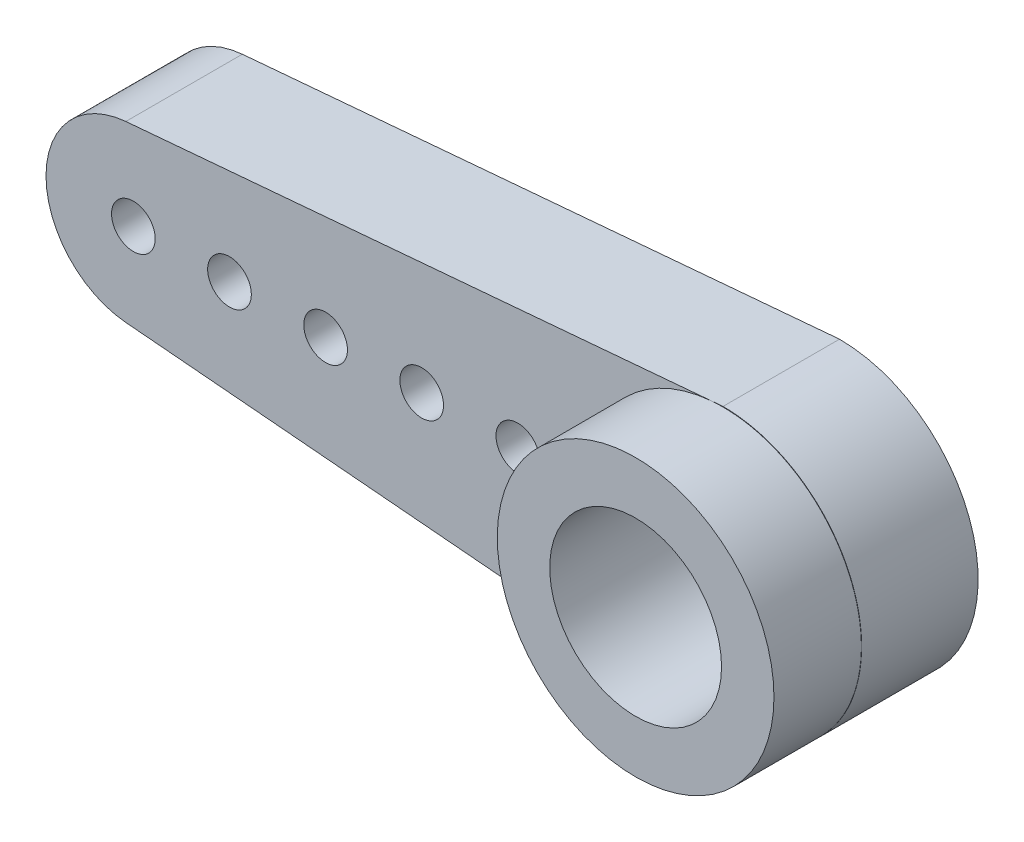
ISO-10303-21;
HEADER;
FILE_DESCRIPTION(('STEP AP214'),'2;1');
FILE_NAME('part.step','',(''),(''),'','','');
FILE_SCHEMA(('AUTOMOTIVE_DESIGN { 1 0 10303 214 1 1 1 1 }'));
ENDSEC;
DATA;
#1=APPLICATION_CONTEXT('core data for automotive mechanical design processes');
#2=APPLICATION_PROTOCOL_DEFINITION('international standard','automotive_design',2000,#1);
#3=PRODUCT_CONTEXT('',#1,'mechanical');
#4=PRODUCT('Part','Part','',(#3));
#5=PRODUCT_RELATED_PRODUCT_CATEGORY('part','',(#4));
#6=PRODUCT_DEFINITION_FORMATION('','',#4);
#7=PRODUCT_DEFINITION_CONTEXT('part definition',#1,'design');
#8=PRODUCT_DEFINITION('design','',#6,#7);
#9=PRODUCT_DEFINITION_SHAPE('','',#8);
#10=(LENGTH_UNIT() NAMED_UNIT(*) SI_UNIT(.MILLI.,.METRE.));
#11=(NAMED_UNIT(*) PLANE_ANGLE_UNIT() SI_UNIT($,.RADIAN.));
#12=(NAMED_UNIT(*) SI_UNIT($,.STERADIAN.) SOLID_ANGLE_UNIT());
#13=UNCERTAINTY_MEASURE_WITH_UNIT(LENGTH_MEASURE(1.E-05),#10,'distance_accuracy_value','');
#14=(GEOMETRIC_REPRESENTATION_CONTEXT(3) GLOBAL_UNCERTAINTY_ASSIGNED_CONTEXT((#13)) GLOBAL_UNIT_ASSIGNED_CONTEXT((#10,
#11,#12)) REPRESENTATION_CONTEXT('',''));
#15=CARTESIAN_POINT('',(0.,0.,0.));
#16=DIRECTION('',(0.,0.,1.));
#17=DIRECTION('',(1.,0.,0.));
#18=AXIS2_PLACEMENT_3D('',#15,#16,#17);
#19=CARTESIAN_POINT('',(0.000772804097320617,0.0089066542155656,4.));
#20=DIRECTION('',(0.,0.,-1.));
#21=DIRECTION('',(-1.,0.,0.));
#22=AXIS2_PLACEMENT_3D('',#19,#20,#21);
#23=PLANE('',#22);
#24=CARTESIAN_POINT('',(0.,0.,4.));
#25=DIRECTION('',(0.,0.,1.));
#26=DIRECTION('',(1.,0.,0.));
#27=AXIS2_PLACEMENT_3D('',#24,#25,#26);
#28=CIRCLE('',#27,4.75);
#29=CARTESIAN_POINT('',(-0.41060076979759,4.73222009292062,4.));
#30=VERTEX_POINT('',#29);
#31=CARTESIAN_POINT('',(-0.410600769797589,-4.73222009292062,4.));
#32=VERTEX_POINT('',#31);
#33=EDGE_CURVE('E48',#30,#32,#28,.T.);
#34=ORIENTED_EDGE('',*,*,#33,.F.);
#35=DIRECTION('',(-0.996256861667499,-0.0864422673258083,0.));
#36=VECTOR('',#35,1.);
#37=CARTESIAN_POINT('',(0.,4.76784670978288,4.));
#38=LINE('',#37,#36);
#39=CARTESIAN_POINT('',(-20.504052607284,2.9887705850025,4.));
#40=VERTEX_POINT('',#39);
#41=EDGE_CURVE('E95',#30,#40,#38,.T.);
#42=ORIENTED_EDGE('',*,*,#41,.T.);
#43=CARTESIAN_POINT('',(-20.2447258053066,0.,4.));
#44=DIRECTION('',(0.,0.,1.));
#45=DIRECTION('',(1.,0.,0.));
#46=AXIS2_PLACEMENT_3D('',#43,#44,#45);
#47=CIRCLE('',#46,3.);
#48=CARTESIAN_POINT('',(-20.504052607284,-2.9887705850025,4.));
#49=VERTEX_POINT('',#48);
#50=EDGE_CURVE('E94',#40,#49,#47,.T.);
#51=ORIENTED_EDGE('',*,*,#50,.T.);
#52=DIRECTION('',(0.996256861667498,-0.0864422673258083,0.));
#53=VECTOR('',#52,1.);
#54=CARTESIAN_POINT('',(-20.504052607284,-2.9887705850025,4.));
#55=LINE('',#54,#53);
#56=EDGE_CURVE('E106',#49,#32,#55,.T.);
#57=ORIENTED_EDGE('',*,*,#56,.T.);
#58=EDGE_LOOP('',(#34,#42,#51,#57));
#59=FACE_BOUND('',#58,.T.);
#60=CARTESIAN_POINT('',(-16.9447258053066,0.,4.));
#61=DIRECTION('',(0.,0.,1.));
#62=DIRECTION('',(1.,0.,0.));
#63=AXIS2_PLACEMENT_3D('',#60,#61,#62);
#64=CIRCLE('',#63,0.750000000000002);
#65=CARTESIAN_POINT('',(-16.1947258053066,0.,4.));
#66=VERTEX_POINT('',#65);
#67=EDGE_CURVE('E159',#66,#66,#64,.T.);
#68=ORIENTED_EDGE('',*,*,#67,.F.);
#69=EDGE_LOOP('',(#68));
#70=FACE_BOUND('',#69,.T.);
#71=CARTESIAN_POINT('',(-13.6447258053066,0.,4.));
#72=DIRECTION('',(0.,0.,1.));
#73=DIRECTION('',(1.,0.,0.));
#74=AXIS2_PLACEMENT_3D('',#71,#72,#73);
#75=CIRCLE('',#74,0.750000000000002);
#76=CARTESIAN_POINT('',(-12.8947258053066,0.,4.));
#77=VERTEX_POINT('',#76);
#78=EDGE_CURVE('E199',#77,#77,#75,.T.);
#79=ORIENTED_EDGE('',*,*,#78,.F.);
#80=EDGE_LOOP('',(#79));
#81=FACE_BOUND('',#80,.T.);
#82=CARTESIAN_POINT('',(-20.2447258053066,0.,4.));
#83=DIRECTION('',(0.,0.,1.));
#84=DIRECTION('',(1.,0.,0.));
#85=AXIS2_PLACEMENT_3D('',#82,#83,#84);
#86=CIRCLE('',#85,0.750000000000002);
#87=CARTESIAN_POINT('',(-19.4947258053066,0.,4.));
#88=VERTEX_POINT('',#87);
#89=EDGE_CURVE('E194',#88,#88,#86,.T.);
#90=ORIENTED_EDGE('',*,*,#89,.F.);
#91=EDGE_LOOP('',(#90));
#92=FACE_BOUND('',#91,.T.);
#93=CARTESIAN_POINT('',(-10.3447258053066,0.,4.));
#94=DIRECTION('',(0.,0.,1.));
#95=DIRECTION('',(1.,0.,0.));
#96=AXIS2_PLACEMENT_3D('',#93,#94,#95);
#97=CIRCLE('',#96,0.750000000000002);
#98=CARTESIAN_POINT('',(-9.59472580530658,0.,4.));
#99=VERTEX_POINT('',#98);
#100=EDGE_CURVE('E189',#99,#99,#97,.T.);
#101=ORIENTED_EDGE('',*,*,#100,.F.);
#102=EDGE_LOOP('',(#101));
#103=FACE_BOUND('',#102,.T.);
#104=CARTESIAN_POINT('',(-7.04472580530658,0.,4.));
#105=DIRECTION('',(0.,0.,1.));
#106=DIRECTION('',(1.,0.,0.));
#107=AXIS2_PLACEMENT_3D('',#104,#105,#106);
#108=CIRCLE('',#107,0.750000000000002);
#109=CARTESIAN_POINT('',(-6.29472580530657,0.,4.));
#110=VERTEX_POINT('',#109);
#111=EDGE_CURVE('E181',#110,#110,#108,.T.);
#112=ORIENTED_EDGE('',*,*,#111,.F.);
#113=EDGE_LOOP('',(#112));
#114=FACE_BOUND('',#113,.T.);
#115=ADVANCED_FACE('F37',(#59,#70,#81,#92,#103,#114),#23,.F.);
#116=EDGE_CURVE('E11',#32,#30,#28,.T.);
#117=ORIENTED_EDGE('',*,*,#116,.F.);
#118=CARTESIAN_POINT('',(0.000772804097320617,0.0089066542155656,4.));
#119=DIRECTION('',(0.,0.,1.));
#120=DIRECTION('',(-1.,0.,0.));
#121=AXIS2_PLACEMENT_3D('',#118,#119,#120);
#122=CIRCLE('',#121,4.75894011831513);
#123=CARTESIAN_POINT('',(0.,4.76784670978288,4.));
#124=VERTEX_POINT('',#123);
#125=EDGE_CURVE('E92',#32,#124,#122,.T.);
#126=ORIENTED_EDGE('',*,*,#125,.T.);
#127=EDGE_CURVE('E87',#124,#30,#38,.T.);
#128=ORIENTED_EDGE('',*,*,#127,.T.);
#129=EDGE_LOOP('',(#117,#126,#128));
#130=FACE_BOUND('',#129,.T.);
#131=ADVANCED_FACE('F90',(#130),#23,.F.);
#132=CARTESIAN_POINT('',(0.000772804097320617,0.0089066542155656,0.));
#133=DIRECTION('',(0.,0.,-1.));
#134=DIRECTION('',(-1.,0.,0.));
#135=AXIS2_PLACEMENT_3D('',#132,#133,#134);
#136=PLANE('',#135);
#137=CARTESIAN_POINT('',(-10.3447258053066,0.,0.));
#138=DIRECTION('',(0.,0.,1.));
#139=DIRECTION('',(1.,0.,0.));
#140=AXIS2_PLACEMENT_3D('',#137,#138,#139);
#141=CIRCLE('',#140,0.750000000000002);
#142=CARTESIAN_POINT('',(-9.59472580530658,0.,0.));
#143=VERTEX_POINT('',#142);
#144=EDGE_CURVE('E184',#143,#143,#141,.T.);
#145=ORIENTED_EDGE('',*,*,#144,.T.);
#146=EDGE_LOOP('',(#145));
#147=FACE_BOUND('',#146,.T.);
#148=CARTESIAN_POINT('',(-13.6447258053066,0.,0.));
#149=DIRECTION('',(0.,0.,1.));
#150=DIRECTION('',(1.,0.,0.));
#151=AXIS2_PLACEMENT_3D('',#148,#149,#150);
#152=CIRCLE('',#151,0.750000000000002);
#153=CARTESIAN_POINT('',(-12.8947258053066,0.,0.));
#154=VERTEX_POINT('',#153);
#155=EDGE_CURVE('E197',#154,#154,#152,.T.);
#156=ORIENTED_EDGE('',*,*,#155,.T.);
#157=EDGE_LOOP('',(#156));
#158=FACE_BOUND('',#157,.T.);
#159=CARTESIAN_POINT('',(0.,0.,0.));
#160=DIRECTION('',(0.,0.,1.));
#161=DIRECTION('',(1.,0.,0.));
#162=AXIS2_PLACEMENT_3D('',#159,#160,#161);
#163=CIRCLE('',#162,2.95);
#164=CARTESIAN_POINT('',(2.95,0.,0.));
#165=VERTEX_POINT('',#164);
#166=EDGE_CURVE('E155',#165,#165,#163,.T.);
#167=ORIENTED_EDGE('',*,*,#166,.T.);
#168=EDGE_LOOP('',(#167));
#169=FACE_BOUND('',#168,.T.);
#170=CARTESIAN_POINT('',(0.000772804097320617,0.0089066542155656,0.));
#171=DIRECTION('',(0.,0.,1.));
#172=DIRECTION('',(-1.,0.,0.));
#173=AXIS2_PLACEMENT_3D('',#170,#171,#172);
#174=CIRCLE('',#173,4.75894011831513);
#175=CARTESIAN_POINT('',(-0.410600769797589,-4.73222009292062,0.));
#176=VERTEX_POINT('',#175);
#177=CARTESIAN_POINT('',(0.,4.76784670978288,0.));
#178=VERTEX_POINT('',#177);
#179=EDGE_CURVE('E151',#176,#178,#174,.T.);
#180=ORIENTED_EDGE('',*,*,#179,.F.);
#181=DIRECTION('',(0.996256861667498,-0.0864422673258083,0.));
#182=VECTOR('',#181,1.);
#183=CARTESIAN_POINT('',(-20.504052607284,-2.9887705850025,0.));
#184=LINE('',#183,#182);
#185=CARTESIAN_POINT('',(-20.504052607284,-2.9887705850025,0.));
#186=VERTEX_POINT('',#185);
#187=EDGE_CURVE('E80',#186,#176,#184,.T.);
#188=ORIENTED_EDGE('',*,*,#187,.F.);
#189=CARTESIAN_POINT('',(-20.2447258053066,0.,0.));
#190=DIRECTION('',(0.,0.,1.));
#191=DIRECTION('',(1.,0.,0.));
#192=AXIS2_PLACEMENT_3D('',#189,#190,#191);
#193=CIRCLE('',#192,3.);
#194=CARTESIAN_POINT('',(-20.504052607284,2.9887705850025,0.));
#195=VERTEX_POINT('',#194);
#196=EDGE_CURVE('E73',#195,#186,#193,.T.);
#197=ORIENTED_EDGE('',*,*,#196,.F.);
#198=DIRECTION('',(-0.996256861667499,-0.0864422673258083,0.));
#199=VECTOR('',#198,1.);
#200=CARTESIAN_POINT('',(0.,4.76784670978288,0.));
#201=LINE('',#200,#199);
#202=EDGE_CURVE('E154',#178,#195,#201,.T.);
#203=ORIENTED_EDGE('',*,*,#202,.F.);
#204=EDGE_LOOP('',(#180,#188,#197,#203));
#205=FACE_BOUND('',#204,.T.);
#206=CARTESIAN_POINT('',(-16.9447258053066,0.,0.));
#207=DIRECTION('',(0.,0.,1.));
#208=DIRECTION('',(1.,0.,0.));
#209=AXIS2_PLACEMENT_3D('',#206,#207,#208);
#210=CIRCLE('',#209,0.750000000000002);
#211=CARTESIAN_POINT('',(-16.1947258053066,0.,0.));
#212=VERTEX_POINT('',#211);
#213=EDGE_CURVE('E172',#212,#212,#210,.T.);
#214=ORIENTED_EDGE('',*,*,#213,.T.);
#215=EDGE_LOOP('',(#214));
#216=FACE_BOUND('',#215,.T.);
#217=CARTESIAN_POINT('',(-20.2447258053066,0.,0.));
#218=DIRECTION('',(0.,0.,1.));
#219=DIRECTION('',(1.,0.,0.));
#220=AXIS2_PLACEMENT_3D('',#217,#218,#219);
#221=CIRCLE('',#220,0.750000000000002);
#222=CARTESIAN_POINT('',(-19.4947258053066,0.,0.));
#223=VERTEX_POINT('',#222);
#224=EDGE_CURVE('E176',#223,#223,#221,.T.);
#225=ORIENTED_EDGE('',*,*,#224,.T.);
#226=EDGE_LOOP('',(#225));
#227=FACE_BOUND('',#226,.T.);
#228=CARTESIAN_POINT('',(-7.04472580530658,0.,0.));
#229=DIRECTION('',(0.,0.,1.));
#230=DIRECTION('',(1.,0.,0.));
#231=AXIS2_PLACEMENT_3D('',#228,#229,#230);
#232=CIRCLE('',#231,0.750000000000002);
#233=CARTESIAN_POINT('',(-6.29472580530657,0.,0.));
#234=VERTEX_POINT('',#233);
#235=EDGE_CURVE('E179',#234,#234,#232,.T.);
#236=ORIENTED_EDGE('',*,*,#235,.T.);
#237=EDGE_LOOP('',(#236));
#238=FACE_BOUND('',#237,.T.);
#239=ADVANCED_FACE('F129',(#147,#158,#169,#205,#216,#227,#238),#136,.T.);
#240=CARTESIAN_POINT('',(0.000772804097320617,0.0089066542155656,4.));
#241=DIRECTION('',(0.,0.,-1.));
#242=DIRECTION('',(-1.,0.,0.));
#243=AXIS2_PLACEMENT_3D('',#240,#241,#242);
#244=CYLINDRICAL_SURFACE('',#243,4.75894011831513);
#245=ORIENTED_EDGE('',*,*,#179,.T.);
#246=DIRECTION('',(0.,0.,-1.));
#247=VECTOR('',#246,1.);
#248=CARTESIAN_POINT('',(0.,4.76784670978288,4.));
#249=LINE('',#248,#247);
#250=EDGE_CURVE('E41',#124,#178,#249,.T.);
#251=ORIENTED_EDGE('',*,*,#250,.F.);
#252=ORIENTED_EDGE('',*,*,#125,.F.);
#253=DIRECTION('',(0.,0.,-1.));
#254=VECTOR('',#253,1.);
#255=CARTESIAN_POINT('',(-0.410600769797589,-4.73222009292062,4.));
#256=LINE('',#255,#254);
#257=EDGE_CURVE('E152',#32,#176,#256,.T.);
#258=ORIENTED_EDGE('',*,*,#257,.T.);
#259=EDGE_LOOP('',(#245,#251,#252,#258));
#260=FACE_BOUND('',#259,.T.);
#261=ADVANCED_FACE('F39',(#260),#244,.T.);
#262=CARTESIAN_POINT('',(0.,4.76784670978288,4.));
#263=DIRECTION('',(0.0864422673258083,-0.996256861667499,0.));
#264=DIRECTION('',(0.996256861667499,0.0864422673258083,0.));
#265=AXIS2_PLACEMENT_3D('',#262,#263,#264);
#266=PLANE('',#265);
#267=ORIENTED_EDGE('',*,*,#202,.T.);
#268=DIRECTION('',(0.,0.,-1.));
#269=VECTOR('',#268,1.);
#270=CARTESIAN_POINT('',(-20.504052607284,2.9887705850025,4.));
#271=LINE('',#270,#269);
#272=EDGE_CURVE('E100',#40,#195,#271,.T.);
#273=ORIENTED_EDGE('',*,*,#272,.F.);
#274=ORIENTED_EDGE('',*,*,#41,.F.);
#275=ORIENTED_EDGE('',*,*,#127,.F.);
#276=ORIENTED_EDGE('',*,*,#250,.T.);
#277=EDGE_LOOP('',(#267,#273,#274,#275,#276));
#278=FACE_BOUND('',#277,.T.);
#279=ADVANCED_FACE('F99',(#278),#266,.F.);
#280=CARTESIAN_POINT('',(-20.2447258053066,0.,4.));
#281=DIRECTION('',(0.,0.,-1.));
#282=DIRECTION('',(-1.,0.,0.));
#283=AXIS2_PLACEMENT_3D('',#280,#281,#282);
#284=CYLINDRICAL_SURFACE('',#283,3.);
#285=ORIENTED_EDGE('',*,*,#196,.T.);
#286=DIRECTION('',(0.,0.,-1.));
#287=VECTOR('',#286,1.);
#288=CARTESIAN_POINT('',(-20.504052607284,-2.9887705850025,4.));
#289=LINE('',#288,#287);
#290=EDGE_CURVE('E167',#49,#186,#289,.T.);
#291=ORIENTED_EDGE('',*,*,#290,.F.);
#292=ORIENTED_EDGE('',*,*,#50,.F.);
#293=ORIENTED_EDGE('',*,*,#272,.T.);
#294=EDGE_LOOP('',(#285,#291,#292,#293));
#295=FACE_BOUND('',#294,.T.);
#296=ADVANCED_FACE('F140',(#295),#284,.T.);
#297=CARTESIAN_POINT('',(-20.504052607284,-2.9887705850025,4.));
#298=DIRECTION('',(0.0864422673258083,0.996256861667499,0.));
#299=DIRECTION('',(-0.996256861667499,0.0864422673258083,0.));
#300=AXIS2_PLACEMENT_3D('',#297,#298,#299);
#301=PLANE('',#300);
#302=ORIENTED_EDGE('',*,*,#187,.T.);
#303=ORIENTED_EDGE('',*,*,#257,.F.);
#304=ORIENTED_EDGE('',*,*,#56,.F.);
#305=ORIENTED_EDGE('',*,*,#290,.T.);
#306=EDGE_LOOP('',(#302,#303,#304,#305));
#307=FACE_BOUND('',#306,.T.);
#308=ADVANCED_FACE('F137',(#307),#301,.F.);
#309=CARTESIAN_POINT('',(0.,0.,4.));
#310=DIRECTION('',(0.,0.,-1.));
#311=DIRECTION('',(-1.,0.,0.));
#312=AXIS2_PLACEMENT_3D('',#309,#310,#311);
#313=CYLINDRICAL_SURFACE('',#312,2.95);
#314=ORIENTED_EDGE('',*,*,#166,.F.);
#315=EDGE_LOOP('',(#314));
#316=FACE_BOUND('',#315,.T.);
#317=CARTESIAN_POINT('',(0.,0.,7.));
#318=DIRECTION('',(0.,0.,1.));
#319=DIRECTION('',(1.,0.,0.));
#320=AXIS2_PLACEMENT_3D('',#317,#318,#319);
#321=CIRCLE('',#320,2.95);
#322=CARTESIAN_POINT('',(2.95,0.,7.));
#323=VERTEX_POINT('',#322);
#324=EDGE_CURVE('E109',#323,#323,#321,.T.);
#325=ORIENTED_EDGE('',*,*,#324,.T.);
#326=EDGE_LOOP('',(#325));
#327=FACE_BOUND('',#326,.T.);
#328=ADVANCED_FACE('F132',(#316,#327),#313,.F.);
#329=CARTESIAN_POINT('',(-16.9447258053066,0.,4.));
#330=DIRECTION('',(0.,0.,-1.));
#331=DIRECTION('',(-1.,0.,0.));
#332=AXIS2_PLACEMENT_3D('',#329,#330,#331);
#333=CYLINDRICAL_SURFACE('',#332,0.750000000000002);
#334=ORIENTED_EDGE('',*,*,#67,.T.);
#335=EDGE_LOOP('',(#334));
#336=FACE_BOUND('',#335,.T.);
#337=ORIENTED_EDGE('',*,*,#213,.F.);
#338=EDGE_LOOP('',(#337));
#339=FACE_BOUND('',#338,.T.);
#340=ADVANCED_FACE('F209',(#336,#339),#333,.F.);
#341=CARTESIAN_POINT('',(-13.6447258053066,0.,4.));
#342=DIRECTION('',(0.,0.,-1.));
#343=DIRECTION('',(-1.,0.,0.));
#344=AXIS2_PLACEMENT_3D('',#341,#342,#343);
#345=CYLINDRICAL_SURFACE('',#344,0.750000000000002);
#346=ORIENTED_EDGE('',*,*,#78,.T.);
#347=EDGE_LOOP('',(#346));
#348=FACE_BOUND('',#347,.T.);
#349=ORIENTED_EDGE('',*,*,#155,.F.);
#350=EDGE_LOOP('',(#349));
#351=FACE_BOUND('',#350,.T.);
#352=ADVANCED_FACE('F230',(#348,#351),#345,.F.);
#353=CARTESIAN_POINT('',(-20.2447258053066,0.,4.));
#354=DIRECTION('',(0.,0.,-1.));
#355=DIRECTION('',(-1.,0.,0.));
#356=AXIS2_PLACEMENT_3D('',#353,#354,#355);
#357=CYLINDRICAL_SURFACE('',#356,0.750000000000002);
#358=ORIENTED_EDGE('',*,*,#89,.T.);
#359=EDGE_LOOP('',(#358));
#360=FACE_BOUND('',#359,.T.);
#361=ORIENTED_EDGE('',*,*,#224,.F.);
#362=EDGE_LOOP('',(#361));
#363=FACE_BOUND('',#362,.T.);
#364=ADVANCED_FACE('F224',(#360,#363),#357,.F.);
#365=CARTESIAN_POINT('',(-10.3447258053066,0.,4.));
#366=DIRECTION('',(0.,0.,-1.));
#367=DIRECTION('',(-1.,0.,0.));
#368=AXIS2_PLACEMENT_3D('',#365,#366,#367);
#369=CYLINDRICAL_SURFACE('',#368,0.750000000000002);
#370=ORIENTED_EDGE('',*,*,#100,.T.);
#371=EDGE_LOOP('',(#370));
#372=FACE_BOUND('',#371,.T.);
#373=ORIENTED_EDGE('',*,*,#144,.F.);
#374=EDGE_LOOP('',(#373));
#375=FACE_BOUND('',#374,.T.);
#376=ADVANCED_FACE('F220',(#372,#375),#369,.F.);
#377=CARTESIAN_POINT('',(-7.04472580530658,0.,4.));
#378=DIRECTION('',(0.,0.,-1.));
#379=DIRECTION('',(-1.,0.,0.));
#380=AXIS2_PLACEMENT_3D('',#377,#378,#379);
#381=CYLINDRICAL_SURFACE('',#380,0.750000000000002);
#382=ORIENTED_EDGE('',*,*,#111,.T.);
#383=EDGE_LOOP('',(#382));
#384=FACE_BOUND('',#383,.T.);
#385=ORIENTED_EDGE('',*,*,#235,.F.);
#386=EDGE_LOOP('',(#385));
#387=FACE_BOUND('',#386,.T.);
#388=ADVANCED_FACE('F118',(#384,#387),#381,.F.);
#389=CARTESIAN_POINT('',(0.,0.,7.));
#390=DIRECTION('',(0.,0.,1.));
#391=DIRECTION('',(1.,0.,0.));
#392=AXIS2_PLACEMENT_3D('',#389,#390,#391);
#393=PLANE('',#392);
#394=CARTESIAN_POINT('',(0.,0.,7.));
#395=DIRECTION('',(0.,0.,1.));
#396=DIRECTION('',(1.,0.,0.));
#397=AXIS2_PLACEMENT_3D('',#394,#395,#396);
#398=CIRCLE('',#397,4.75);
#399=CARTESIAN_POINT('',(4.75,0.,7.));
#400=VERTEX_POINT('',#399);
#401=EDGE_CURVE('E108',#400,#400,#398,.T.);
#402=ORIENTED_EDGE('',*,*,#401,.T.);
#403=EDGE_LOOP('',(#402));
#404=FACE_BOUND('',#403,.T.);
#405=ORIENTED_EDGE('',*,*,#324,.F.);
#406=EDGE_LOOP('',(#405));
#407=FACE_BOUND('',#406,.T.);
#408=ADVANCED_FACE('F112',(#404,#407),#393,.T.);
#409=CARTESIAN_POINT('',(0.,0.,7.));
#410=DIRECTION('',(0.,0.,-1.));
#411=DIRECTION('',(-1.,0.,0.));
#412=AXIS2_PLACEMENT_3D('',#409,#410,#411);
#413=CYLINDRICAL_SURFACE('',#412,4.75);
#414=ORIENTED_EDGE('',*,*,#401,.F.);
#415=EDGE_LOOP('',(#414));
#416=FACE_BOUND('',#415,.T.);
#417=ORIENTED_EDGE('',*,*,#33,.T.);
#418=ORIENTED_EDGE('',*,*,#116,.T.);
#419=EDGE_LOOP('',(#417,#418));
#420=FACE_BOUND('',#419,.T.);
#421=ADVANCED_FACE('F110',(#416,#420),#413,.T.);
#422=CLOSED_SHELL('',(#115,#131,#239,#261,#279,#296,#308,#328,#340,#352,#364,#376,#388,#408,#421));
#423=MANIFOLD_SOLID_BREP('B2',#422);
#424=ADVANCED_BREP_SHAPE_REPRESENTATION('',(#18,#423),#14);
#425=SHAPE_DEFINITION_REPRESENTATION(#9,#424);
ENDSEC;
END-ISO-10303-21;
